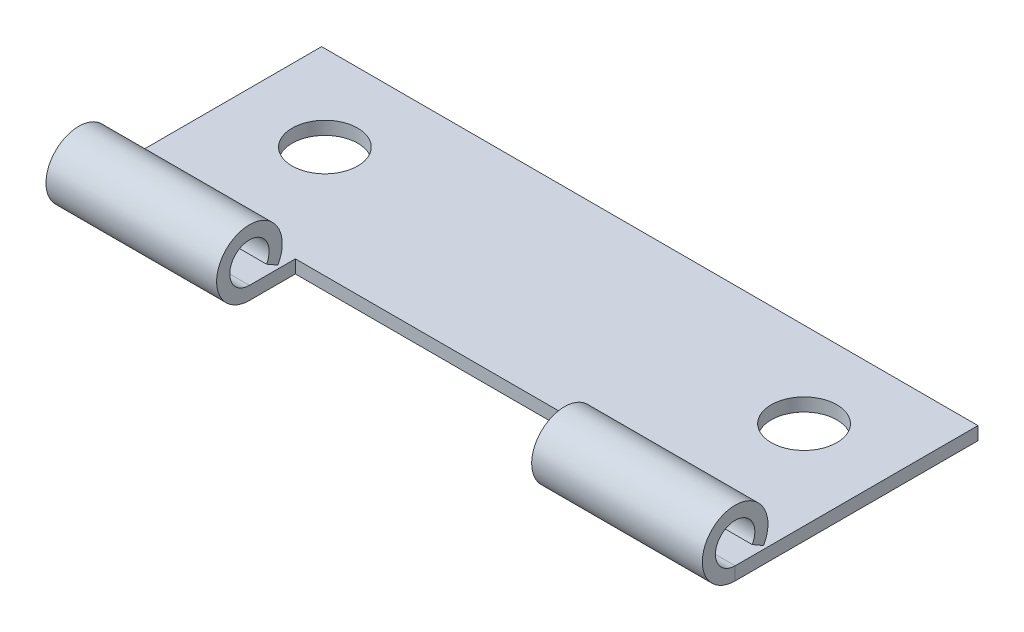
ISO-10303-21;
HEADER;
FILE_DESCRIPTION(('STEP AP214'),'2;1');
FILE_NAME('part.step','',(''),(''),'','','');
FILE_SCHEMA(('AUTOMOTIVE_DESIGN { 1 0 10303 214 1 1 1 1 }'));
ENDSEC;
DATA;
#1=APPLICATION_CONTEXT('core data for automotive mechanical design processes');
#2=APPLICATION_PROTOCOL_DEFINITION('international standard','automotive_design',2000,#1);
#3=PRODUCT_CONTEXT('',#1,'mechanical');
#4=PRODUCT('Part','Part','',(#3));
#5=PRODUCT_RELATED_PRODUCT_CATEGORY('part','',(#4));
#6=PRODUCT_DEFINITION_FORMATION('','',#4);
#7=PRODUCT_DEFINITION_CONTEXT('part definition',#1,'design');
#8=PRODUCT_DEFINITION('design','',#6,#7);
#9=PRODUCT_DEFINITION_SHAPE('','',#8);
#10=(LENGTH_UNIT() NAMED_UNIT(*) SI_UNIT(.MILLI.,.METRE.));
#11=(NAMED_UNIT(*) PLANE_ANGLE_UNIT() SI_UNIT($,.RADIAN.));
#12=(NAMED_UNIT(*) SI_UNIT($,.STERADIAN.) SOLID_ANGLE_UNIT());
#13=UNCERTAINTY_MEASURE_WITH_UNIT(LENGTH_MEASURE(1.E-05),#10,'distance_accuracy_value','');
#14=(GEOMETRIC_REPRESENTATION_CONTEXT(3) GLOBAL_UNCERTAINTY_ASSIGNED_CONTEXT((#13)) GLOBAL_UNIT_ASSIGNED_CONTEXT((#10,
#11,#12)) REPRESENTATION_CONTEXT('',''));
#15=CARTESIAN_POINT('',(0.,0.,0.));
#16=DIRECTION('',(0.,0.,1.));
#17=DIRECTION('',(1.,0.,0.));
#18=AXIS2_PLACEMENT_3D('',#15,#16,#17);
#19=CARTESIAN_POINT('',(0.,0.749999999999984,6.70096189432335));
#20=DIRECTION('',(0.,0.866025403784433,-0.50000000000001));
#21=DIRECTION('',(1.,0.,0.));
#22=AXIS2_PLACEMENT_3D('',#19,#20,#21);
#23=PLANE('',#22);
#24=DIRECTION('',(0.,0.50000000000001,0.866025403784433));
#25=VECTOR('',#24,1.);
#26=CARTESIAN_POINT('',(-12.,0.749999999999985,6.70096189432335));
#27=LINE('',#26,#25);
#28=CARTESIAN_POINT('',(-12.,0.749999999999984,6.70096189432335));
#29=VERTEX_POINT('',#28);
#30=CARTESIAN_POINT('',(-12.,0.249999999999975,5.83493649053892));
#31=VERTEX_POINT('',#30);
#32=EDGE_CURVE('E159',#29,#31,#27,.F.);
#33=ORIENTED_EDGE('',*,*,#32,.F.);
#34=DIRECTION('',(1.,0.,0.));
#35=VECTOR('',#34,1.);
#36=CARTESIAN_POINT('',(25.,0.749999999999982,6.70096189432335));
#37=LINE('',#36,#35);
#38=CARTESIAN_POINT('',(-25.,0.749999999999986,6.70096189432335));
#39=VERTEX_POINT('',#38);
#40=EDGE_CURVE('E189',#39,#29,#37,.T.);
#41=ORIENTED_EDGE('',*,*,#40,.F.);
#42=DIRECTION('',(0.,-0.50000000000001,-0.866025403784433));
#43=VECTOR('',#42,1.);
#44=CARTESIAN_POINT('',(-25.,0.749999999999986,6.70096189432335));
#45=LINE('',#44,#43);
#46=CARTESIAN_POINT('',(-25.,0.249999999999976,5.83493649053892));
#47=VERTEX_POINT('',#46);
#48=EDGE_CURVE('E195',#39,#47,#45,.T.);
#49=ORIENTED_EDGE('',*,*,#48,.T.);
#50=DIRECTION('',(1.,0.,0.));
#51=VECTOR('',#50,1.);
#52=CARTESIAN_POINT('',(25.,0.249999999999972,5.83493649053892));
#53=LINE('',#52,#51);
#54=EDGE_CURVE('E172',#47,#31,#53,.T.);
#55=ORIENTED_EDGE('',*,*,#54,.T.);
#56=EDGE_LOOP('',(#33,#41,#49,#55));
#57=FACE_BOUND('',#56,.T.);
#58=ADVANCED_FACE('F35',(#57),#23,.F.);
#59=CARTESIAN_POINT('',(25.,1.5,8.));
#60=DIRECTION('',(1.,0.,0.));
#61=DIRECTION('',(0.,-0.50000000000001,-0.866025403784433));
#62=AXIS2_PLACEMENT_3D('',#59,#60,#61);
#63=CYLINDRICAL_SURFACE('',#62,2.5);
#64=CARTESIAN_POINT('',(12.,1.5,8.));
#65=DIRECTION('',(1.,0.,0.));
#66=DIRECTION('',(0.,0.,-1.));
#67=AXIS2_PLACEMENT_3D('',#64,#65,#66);
#68=CIRCLE('',#67,2.5);
#69=CARTESIAN_POINT('',(12.,-1.,8.));
#70=VERTEX_POINT('',#69);
#71=CARTESIAN_POINT('',(12.,0.249999999999974,5.83493649053892));
#72=VERTEX_POINT('',#71);
#73=EDGE_CURVE('E157',#70,#72,#68,.F.);
#74=ORIENTED_EDGE('',*,*,#73,.F.);
#75=DIRECTION('',(1.,0.,0.));
#76=VECTOR('',#75,1.);
#77=CARTESIAN_POINT('',(25.,-1.,8.));
#78=LINE('',#77,#76);
#79=CARTESIAN_POINT('',(25.,-1.,7.99999999999999));
#80=VERTEX_POINT('',#79);
#81=EDGE_CURVE('E147',#80,#70,#78,.F.);
#82=ORIENTED_EDGE('',*,*,#81,.F.);
#83=CARTESIAN_POINT('',(25.,1.5,8.));
#84=DIRECTION('',(1.,0.,0.));
#85=DIRECTION('',(0.,1.,0.));
#86=AXIS2_PLACEMENT_3D('',#83,#84,#85);
#87=CIRCLE('',#86,2.5);
#88=CARTESIAN_POINT('',(25.,0.249999999999972,5.83493649053892));
#89=VERTEX_POINT('',#88);
#90=EDGE_CURVE('E175',#89,#80,#87,.T.);
#91=ORIENTED_EDGE('',*,*,#90,.F.);
#92=EDGE_CURVE('E176',#72,#89,#53,.T.);
#93=ORIENTED_EDGE('',*,*,#92,.F.);
#94=EDGE_LOOP('',(#74,#82,#91,#93));
#95=FACE_BOUND('',#94,.T.);
#96=ADVANCED_FACE('F256',(#95),#63,.T.);
#97=CARTESIAN_POINT('',(25.,1.5,8.));
#98=DIRECTION('',(1.,0.,0.));
#99=DIRECTION('',(0.,-0.50000000000001,-0.866025403784433));
#100=AXIS2_PLACEMENT_3D('',#97,#98,#99);
#101=CYLINDRICAL_SURFACE('',#100,1.5);
#102=ORIENTED_EDGE('',*,*,#40,.T.);
#103=CARTESIAN_POINT('',(-12.,1.5,8.));
#104=DIRECTION('',(-1.,0.,0.));
#105=DIRECTION('',(0.,0.,1.));
#106=AXIS2_PLACEMENT_3D('',#103,#104,#105);
#107=CIRCLE('',#106,1.5);
#108=CARTESIAN_POINT('',(-12.,0.,8.));
#109=VERTEX_POINT('',#108);
#110=EDGE_CURVE('E44',#29,#109,#107,.F.);
#111=ORIENTED_EDGE('',*,*,#110,.T.);
#112=DIRECTION('',(1.,0.,0.));
#113=VECTOR('',#112,1.);
#114=CARTESIAN_POINT('',(25.,0.,8.));
#115=LINE('',#114,#113);
#116=CARTESIAN_POINT('',(-25.,0.,8.));
#117=VERTEX_POINT('',#116);
#118=EDGE_CURVE('E185',#109,#117,#115,.F.);
#119=ORIENTED_EDGE('',*,*,#118,.T.);
#120=CARTESIAN_POINT('',(-25.,1.5,8.));
#121=DIRECTION('',(1.,0.,0.));
#122=DIRECTION('',(0.,1.,0.));
#123=AXIS2_PLACEMENT_3D('',#120,#121,#122);
#124=CIRCLE('',#123,1.5);
#125=EDGE_CURVE('E179',#117,#39,#124,.F.);
#126=ORIENTED_EDGE('',*,*,#125,.T.);
#127=EDGE_LOOP('',(#102,#111,#119,#126));
#128=FACE_BOUND('',#127,.T.);
#129=ADVANCED_FACE('F262',(#128),#101,.F.);
#130=CARTESIAN_POINT('',(25.,-1.,-10.5));
#131=DIRECTION('',(1.,0.,0.));
#132=DIRECTION('',(0.,0.,-1.));
#133=AXIS2_PLACEMENT_3D('',#130,#131,#132);
#134=PLANE('',#133);
#135=DIRECTION('',(0.,0.,-1.));
#136=VECTOR('',#135,1.);
#137=CARTESIAN_POINT('',(25.,0.,-10.5));
#138=LINE('',#137,#136);
#139=CARTESIAN_POINT('',(25.,0.,7.99999999999999));
#140=VERTEX_POINT('',#139);
#141=CARTESIAN_POINT('',(25.,0.,-10.5));
#142=VERTEX_POINT('',#141);
#143=EDGE_CURVE('E200',#140,#142,#138,.T.);
#144=ORIENTED_EDGE('',*,*,#143,.F.);
#145=DIRECTION('',(0.,-1.,0.));
#146=VECTOR('',#145,1.);
#147=CARTESIAN_POINT('',(25.,0.,8.));
#148=LINE('',#147,#146);
#149=EDGE_CURVE('E60',#140,#80,#148,.T.);
#150=ORIENTED_EDGE('',*,*,#149,.T.);
#151=DIRECTION('',(0.,0.,-1.));
#152=VECTOR('',#151,1.);
#153=CARTESIAN_POINT('',(25.,-1.,-10.5));
#154=LINE('',#153,#152);
#155=CARTESIAN_POINT('',(25.,-1.,-10.5));
#156=VERTEX_POINT('',#155);
#157=EDGE_CURVE('E202',#80,#156,#154,.T.);
#158=ORIENTED_EDGE('',*,*,#157,.T.);
#159=DIRECTION('',(0.,1.,0.));
#160=VECTOR('',#159,1.);
#161=CARTESIAN_POINT('',(25.,-1.,-10.5));
#162=LINE('',#161,#160);
#163=EDGE_CURVE('E211',#156,#142,#162,.T.);
#164=ORIENTED_EDGE('',*,*,#163,.T.);
#165=EDGE_LOOP('',(#144,#150,#158,#164));
#166=FACE_BOUND('',#165,.T.);
#167=ADVANCED_FACE('F37',(#166),#134,.T.);
#168=CARTESIAN_POINT('',(-25.,-1.,-10.5));
#169=DIRECTION('',(-1.,0.,0.));
#170=DIRECTION('',(0.,0.,1.));
#171=AXIS2_PLACEMENT_3D('',#168,#169,#170);
#172=PLANE('',#171);
#173=DIRECTION('',(0.,-1.,0.));
#174=VECTOR('',#173,1.);
#175=CARTESIAN_POINT('',(-25.,0.,8.));
#176=LINE('',#175,#174);
#177=CARTESIAN_POINT('',(-25.,-1.,8.));
#178=VERTEX_POINT('',#177);
#179=EDGE_CURVE('E192',#117,#178,#176,.T.);
#180=ORIENTED_EDGE('',*,*,#179,.F.);
#181=DIRECTION('',(0.,0.,1.));
#182=VECTOR('',#181,1.);
#183=CARTESIAN_POINT('',(-25.,0.,-10.5));
#184=LINE('',#183,#182);
#185=CARTESIAN_POINT('',(-25.,0.,-10.5));
#186=VERTEX_POINT('',#185);
#187=EDGE_CURVE('E205',#186,#117,#184,.T.);
#188=ORIENTED_EDGE('',*,*,#187,.F.);
#189=DIRECTION('',(0.,1.,0.));
#190=VECTOR('',#189,1.);
#191=CARTESIAN_POINT('',(-25.,-1.,-10.5));
#192=LINE('',#191,#190);
#193=CARTESIAN_POINT('',(-25.,-1.,-10.5));
#194=VERTEX_POINT('',#193);
#195=EDGE_CURVE('E218',#194,#186,#192,.T.);
#196=ORIENTED_EDGE('',*,*,#195,.F.);
#197=DIRECTION('',(0.,0.,1.));
#198=VECTOR('',#197,1.);
#199=CARTESIAN_POINT('',(-25.,-1.,-10.5));
#200=LINE('',#199,#198);
#201=EDGE_CURVE('E208',#194,#178,#200,.T.);
#202=ORIENTED_EDGE('',*,*,#201,.T.);
#203=EDGE_LOOP('',(#180,#188,#196,#202));
#204=FACE_BOUND('',#203,.T.);
#205=ADVANCED_FACE('F252',(#204),#172,.T.);
#206=CARTESIAN_POINT('',(-25.,-1.,-10.5));
#207=DIRECTION('',(0.,0.,-1.));
#208=DIRECTION('',(-1.,0.,0.));
#209=AXIS2_PLACEMENT_3D('',#206,#207,#208);
#210=PLANE('',#209);
#211=DIRECTION('',(-1.,0.,0.));
#212=VECTOR('',#211,1.);
#213=CARTESIAN_POINT('',(-25.,0.,-10.5));
#214=LINE('',#213,#212);
#215=EDGE_CURVE('E213',#142,#186,#214,.T.);
#216=ORIENTED_EDGE('',*,*,#215,.F.);
#217=ORIENTED_EDGE('',*,*,#163,.F.);
#218=DIRECTION('',(-1.,0.,0.));
#219=VECTOR('',#218,1.);
#220=CARTESIAN_POINT('',(-25.,-1.,-10.5));
#221=LINE('',#220,#219);
#222=EDGE_CURVE('E204',#156,#194,#221,.T.);
#223=ORIENTED_EDGE('',*,*,#222,.T.);
#224=ORIENTED_EDGE('',*,*,#195,.T.);
#225=EDGE_LOOP('',(#216,#217,#223,#224));
#226=FACE_BOUND('',#225,.T.);
#227=ADVANCED_FACE('F243',(#226),#210,.T.);
#228=CARTESIAN_POINT('',(25.,-1.,10.5));
#229=DIRECTION('',(0.,1.,0.));
#230=DIRECTION('',(0.,0.,1.));
#231=AXIS2_PLACEMENT_3D('',#228,#229,#230);
#232=PLANE('',#231);
#233=CARTESIAN_POINT('',(-18.25,-1.,-4.));
#234=DIRECTION('',(0.,-1.,0.));
#235=DIRECTION('',(0.,0.,-1.));
#236=AXIS2_PLACEMENT_3D('',#233,#234,#235);
#237=CIRCLE('',#236,2.5);
#238=CARTESIAN_POINT('',(-18.25,-1.,-6.5));
#239=VERTEX_POINT('',#238);
#240=EDGE_CURVE('E233',#239,#239,#237,.T.);
#241=ORIENTED_EDGE('',*,*,#240,.F.);
#242=EDGE_LOOP('',(#241));
#243=FACE_BOUND('',#242,.T.);
#244=CARTESIAN_POINT('',(18.25,-1.,-4.));
#245=DIRECTION('',(0.,-1.,0.));
#246=DIRECTION('',(0.,0.,-1.));
#247=AXIS2_PLACEMENT_3D('',#244,#245,#246);
#248=CIRCLE('',#247,2.5);
#249=CARTESIAN_POINT('',(18.25,-1.,-6.50000000000001));
#250=VERTEX_POINT('',#249);
#251=EDGE_CURVE('E226',#250,#250,#248,.T.);
#252=ORIENTED_EDGE('',*,*,#251,.F.);
#253=EDGE_LOOP('',(#252));
#254=FACE_BOUND('',#253,.T.);
#255=DIRECTION('',(-1.,0.,0.));
#256=VECTOR('',#255,1.);
#257=CARTESIAN_POINT('',(-12.,-1.,4.5));
#258=LINE('',#257,#256);
#259=CARTESIAN_POINT('',(12.,-1.,4.49999999999999));
#260=VERTEX_POINT('',#259);
#261=CARTESIAN_POINT('',(-12.,-1.,4.5));
#262=VERTEX_POINT('',#261);
#263=EDGE_CURVE('E135',#260,#262,#258,.T.);
#264=ORIENTED_EDGE('',*,*,#263,.T.);
#265=DIRECTION('',(0.,0.,1.));
#266=VECTOR('',#265,1.);
#267=CARTESIAN_POINT('',(-12.,-1.,4.5));
#268=LINE('',#267,#266);
#269=CARTESIAN_POINT('',(-12.,-1.,8.));
#270=VERTEX_POINT('',#269);
#271=EDGE_CURVE('E148',#262,#270,#268,.T.);
#272=ORIENTED_EDGE('',*,*,#271,.T.);
#273=EDGE_CURVE('E169',#270,#178,#78,.F.);
#274=ORIENTED_EDGE('',*,*,#273,.T.);
#275=ORIENTED_EDGE('',*,*,#201,.F.);
#276=ORIENTED_EDGE('',*,*,#222,.F.);
#277=ORIENTED_EDGE('',*,*,#157,.F.);
#278=ORIENTED_EDGE('',*,*,#81,.T.);
#279=DIRECTION('',(0.,0.,-1.));
#280=VECTOR('',#279,1.);
#281=CARTESIAN_POINT('',(12.,-1.,4.49999999999999));
#282=LINE('',#281,#280);
#283=EDGE_CURVE('E128',#70,#260,#282,.T.);
#284=ORIENTED_EDGE('',*,*,#283,.T.);
#285=EDGE_LOOP('',(#264,#272,#274,#275,#276,#277,#278,#284));
#286=FACE_BOUND('',#285,.T.);
#287=ADVANCED_FACE('F145',(#243,#254,#286),#232,.F.);
#288=CARTESIAN_POINT('',(25.,0.,10.5));
#289=DIRECTION('',(0.,1.,0.));
#290=DIRECTION('',(0.,0.,1.));
#291=AXIS2_PLACEMENT_3D('',#288,#289,#290);
#292=PLANE('',#291);
#293=CARTESIAN_POINT('',(-18.25,0.,-4.));
#294=DIRECTION('',(0.,1.,0.));
#295=DIRECTION('',(0.,0.,1.));
#296=AXIS2_PLACEMENT_3D('',#293,#294,#295);
#297=CIRCLE('',#296,2.5);
#298=CARTESIAN_POINT('',(-18.25,0.,-1.5));
#299=VERTEX_POINT('',#298);
#300=EDGE_CURVE('E39',#299,#299,#297,.T.);
#301=ORIENTED_EDGE('',*,*,#300,.F.);
#302=EDGE_LOOP('',(#301));
#303=FACE_BOUND('',#302,.T.);
#304=CARTESIAN_POINT('',(18.25,0.,-4.));
#305=DIRECTION('',(0.,1.,0.));
#306=DIRECTION('',(0.,0.,1.));
#307=AXIS2_PLACEMENT_3D('',#304,#305,#306);
#308=CIRCLE('',#307,2.5);
#309=CARTESIAN_POINT('',(18.25,0.,-1.5));
#310=VERTEX_POINT('',#309);
#311=EDGE_CURVE('E150',#310,#310,#308,.T.);
#312=ORIENTED_EDGE('',*,*,#311,.F.);
#313=EDGE_LOOP('',(#312));
#314=FACE_BOUND('',#313,.T.);
#315=DIRECTION('',(0.,0.,1.));
#316=VECTOR('',#315,1.);
#317=CARTESIAN_POINT('',(-12.,0.,10.5));
#318=LINE('',#317,#316);
#319=CARTESIAN_POINT('',(-12.,0.,4.5));
#320=VERTEX_POINT('',#319);
#321=EDGE_CURVE('E162',#320,#109,#318,.T.);
#322=ORIENTED_EDGE('',*,*,#321,.F.);
#323=DIRECTION('',(-1.,0.,0.));
#324=VECTOR('',#323,1.);
#325=CARTESIAN_POINT('',(25.,0.,4.49999999999999));
#326=LINE('',#325,#324);
#327=CARTESIAN_POINT('',(12.,0.,4.49999999999999));
#328=VERTEX_POINT('',#327);
#329=EDGE_CURVE('E11',#328,#320,#326,.T.);
#330=ORIENTED_EDGE('',*,*,#329,.F.);
#331=DIRECTION('',(0.,0.,-1.));
#332=VECTOR('',#331,1.);
#333=CARTESIAN_POINT('',(12.,0.,10.5));
#334=LINE('',#333,#332);
#335=CARTESIAN_POINT('',(12.,0.,8.));
#336=VERTEX_POINT('',#335);
#337=EDGE_CURVE('E131',#336,#328,#334,.T.);
#338=ORIENTED_EDGE('',*,*,#337,.F.);
#339=EDGE_CURVE('E182',#140,#336,#115,.F.);
#340=ORIENTED_EDGE('',*,*,#339,.F.);
#341=ORIENTED_EDGE('',*,*,#143,.T.);
#342=ORIENTED_EDGE('',*,*,#215,.T.);
#343=ORIENTED_EDGE('',*,*,#187,.T.);
#344=ORIENTED_EDGE('',*,*,#118,.F.);
#345=EDGE_LOOP('',(#322,#330,#338,#340,#341,#342,#343,#344));
#346=FACE_BOUND('',#345,.T.);
#347=ADVANCED_FACE('F242',(#303,#314,#346),#292,.T.);
#348=DIRECTION('',(0.,-0.50000000000001,-0.866025403784433));
#349=VECTOR('',#348,1.);
#350=CARTESIAN_POINT('',(12.,0.749999999999984,6.70096189432335));
#351=LINE('',#350,#349);
#352=CARTESIAN_POINT('',(12.,0.749999999999983,6.70096189432335));
#353=VERTEX_POINT('',#352);
#354=EDGE_CURVE('E52',#72,#353,#351,.F.);
#355=ORIENTED_EDGE('',*,*,#354,.F.);
#356=ORIENTED_EDGE('',*,*,#92,.T.);
#357=DIRECTION('',(0.,-0.50000000000001,-0.866025403784433));
#358=VECTOR('',#357,1.);
#359=CARTESIAN_POINT('',(25.,0.749999999999982,6.70096189432335));
#360=LINE('',#359,#358);
#361=CARTESIAN_POINT('',(25.,0.749999999999982,6.70096189432335));
#362=VERTEX_POINT('',#361);
#363=EDGE_CURVE('E197',#362,#89,#360,.T.);
#364=ORIENTED_EDGE('',*,*,#363,.F.);
#365=EDGE_CURVE('E166',#353,#362,#37,.T.);
#366=ORIENTED_EDGE('',*,*,#365,.F.);
#367=EDGE_LOOP('',(#355,#356,#364,#366));
#368=FACE_BOUND('',#367,.T.);
#369=ADVANCED_FACE('F249',(#368),#23,.F.);
#370=CARTESIAN_POINT('',(-25.,1.5,8.));
#371=DIRECTION('',(-1.,0.,0.));
#372=DIRECTION('',(0.,-1.,0.));
#373=AXIS2_PLACEMENT_3D('',#370,#371,#372);
#374=PLANE('',#373);
#375=ORIENTED_EDGE('',*,*,#48,.F.);
#376=ORIENTED_EDGE('',*,*,#125,.F.);
#377=ORIENTED_EDGE('',*,*,#179,.T.);
#378=CARTESIAN_POINT('',(-25.,1.5,8.));
#379=DIRECTION('',(1.,0.,0.));
#380=DIRECTION('',(0.,1.,0.));
#381=AXIS2_PLACEMENT_3D('',#378,#379,#380);
#382=CIRCLE('',#381,2.5);
#383=EDGE_CURVE('E168',#178,#47,#382,.F.);
#384=ORIENTED_EDGE('',*,*,#383,.T.);
#385=EDGE_LOOP('',(#375,#376,#377,#384));
#386=FACE_BOUND('',#385,.T.);
#387=ADVANCED_FACE('F269',(#386),#374,.T.);
#388=CARTESIAN_POINT('',(25.,1.5,8.));
#389=DIRECTION('',(-1.,0.,0.));
#390=DIRECTION('',(0.,-1.,0.));
#391=AXIS2_PLACEMENT_3D('',#388,#389,#390);
#392=PLANE('',#391);
#393=CARTESIAN_POINT('',(25.,1.5,8.));
#394=DIRECTION('',(1.,0.,0.));
#395=DIRECTION('',(0.,1.,0.));
#396=AXIS2_PLACEMENT_3D('',#393,#394,#395);
#397=CIRCLE('',#396,1.5);
#398=EDGE_CURVE('E186',#362,#140,#397,.T.);
#399=ORIENTED_EDGE('',*,*,#398,.F.);
#400=ORIENTED_EDGE('',*,*,#363,.T.);
#401=ORIENTED_EDGE('',*,*,#90,.T.);
#402=ORIENTED_EDGE('',*,*,#149,.F.);
#403=EDGE_LOOP('',(#399,#400,#401,#402));
#404=FACE_BOUND('',#403,.T.);
#405=ADVANCED_FACE('F274',(#404),#392,.F.);
#406=CARTESIAN_POINT('',(-12.,1.5,8.));
#407=DIRECTION('',(-1.,0.,0.));
#408=DIRECTION('',(0.,0.,1.));
#409=AXIS2_PLACEMENT_3D('',#406,#407,#408);
#410=CIRCLE('',#409,2.5);
#411=EDGE_CURVE('E164',#31,#270,#410,.F.);
#412=ORIENTED_EDGE('',*,*,#411,.F.);
#413=ORIENTED_EDGE('',*,*,#54,.F.);
#414=ORIENTED_EDGE('',*,*,#383,.F.);
#415=ORIENTED_EDGE('',*,*,#273,.F.);
#416=EDGE_LOOP('',(#412,#413,#414,#415));
#417=FACE_BOUND('',#416,.T.);
#418=ADVANCED_FACE('F265',(#417),#63,.T.);
#419=ORIENTED_EDGE('',*,*,#339,.T.);
#420=CARTESIAN_POINT('',(12.,1.5,8.));
#421=DIRECTION('',(1.,0.,0.));
#422=DIRECTION('',(0.,0.,-1.));
#423=AXIS2_PLACEMENT_3D('',#420,#421,#422);
#424=CIRCLE('',#423,1.5);
#425=EDGE_CURVE('E220',#336,#353,#424,.F.);
#426=ORIENTED_EDGE('',*,*,#425,.T.);
#427=ORIENTED_EDGE('',*,*,#365,.T.);
#428=ORIENTED_EDGE('',*,*,#398,.T.);
#429=EDGE_LOOP('',(#419,#426,#427,#428));
#430=FACE_BOUND('',#429,.T.);
#431=ADVANCED_FACE('F283',(#430),#101,.F.);
#432=CARTESIAN_POINT('',(-12.,-1.,4.5));
#433=DIRECTION('',(-1.,0.,0.));
#434=DIRECTION('',(0.,0.,1.));
#435=AXIS2_PLACEMENT_3D('',#432,#433,#434);
#436=PLANE('',#435);
#437=ORIENTED_EDGE('',*,*,#411,.T.);
#438=ORIENTED_EDGE('',*,*,#271,.F.);
#439=DIRECTION('',(0.,1.,0.));
#440=VECTOR('',#439,1.);
#441=CARTESIAN_POINT('',(-12.,-1.,4.5));
#442=LINE('',#441,#440);
#443=EDGE_CURVE('E134',#262,#320,#442,.T.);
#444=ORIENTED_EDGE('',*,*,#443,.T.);
#445=ORIENTED_EDGE('',*,*,#321,.T.);
#446=ORIENTED_EDGE('',*,*,#110,.F.);
#447=ORIENTED_EDGE('',*,*,#32,.T.);
#448=EDGE_LOOP('',(#437,#438,#444,#445,#446,#447));
#449=FACE_BOUND('',#448,.T.);
#450=ADVANCED_FACE('F288',(#449),#436,.F.);
#451=CARTESIAN_POINT('',(-12.,-1.,4.5));
#452=DIRECTION('',(0.,0.,-1.));
#453=DIRECTION('',(-1.,0.,0.));
#454=AXIS2_PLACEMENT_3D('',#451,#452,#453);
#455=PLANE('',#454);
#456=ORIENTED_EDGE('',*,*,#329,.T.);
#457=ORIENTED_EDGE('',*,*,#443,.F.);
#458=ORIENTED_EDGE('',*,*,#263,.F.);
#459=DIRECTION('',(0.,1.,0.));
#460=VECTOR('',#459,1.);
#461=CARTESIAN_POINT('',(12.,-1.,4.49999999999999));
#462=LINE('',#461,#460);
#463=EDGE_CURVE('E124',#260,#328,#462,.T.);
#464=ORIENTED_EDGE('',*,*,#463,.T.);
#465=EDGE_LOOP('',(#456,#457,#458,#464));
#466=FACE_BOUND('',#465,.T.);
#467=ADVANCED_FACE('F138',(#466),#455,.F.);
#468=CARTESIAN_POINT('',(12.,-1.,4.49999999999999));
#469=DIRECTION('',(1.,0.,0.));
#470=DIRECTION('',(0.,0.,-1.));
#471=AXIS2_PLACEMENT_3D('',#468,#469,#470);
#472=PLANE('',#471);
#473=ORIENTED_EDGE('',*,*,#73,.T.);
#474=ORIENTED_EDGE('',*,*,#354,.T.);
#475=ORIENTED_EDGE('',*,*,#425,.F.);
#476=ORIENTED_EDGE('',*,*,#337,.T.);
#477=ORIENTED_EDGE('',*,*,#463,.F.);
#478=ORIENTED_EDGE('',*,*,#283,.F.);
#479=EDGE_LOOP('',(#473,#474,#475,#476,#477,#478));
#480=FACE_BOUND('',#479,.T.);
#481=ADVANCED_FACE('F126',(#480),#472,.F.);
#482=CARTESIAN_POINT('',(18.25,4.,-4.));
#483=DIRECTION('',(0.,-1.,0.));
#484=DIRECTION('',(0.,0.,-1.));
#485=AXIS2_PLACEMENT_3D('',#482,#483,#484);
#486=CYLINDRICAL_SURFACE('',#485,2.5);
#487=ORIENTED_EDGE('',*,*,#311,.T.);
#488=EDGE_LOOP('',(#487));
#489=FACE_BOUND('',#488,.T.);
#490=ORIENTED_EDGE('',*,*,#251,.T.);
#491=EDGE_LOOP('',(#490));
#492=FACE_BOUND('',#491,.T.);
#493=ADVANCED_FACE('F357',(#489,#492),#486,.F.);
#494=CARTESIAN_POINT('',(-18.25,4.,-4.));
#495=DIRECTION('',(0.,-1.,0.));
#496=DIRECTION('',(0.,0.,-1.));
#497=AXIS2_PLACEMENT_3D('',#494,#495,#496);
#498=CYLINDRICAL_SURFACE('',#497,2.5);
#499=ORIENTED_EDGE('',*,*,#300,.T.);
#500=EDGE_LOOP('',(#499));
#501=FACE_BOUND('',#500,.T.);
#502=ORIENTED_EDGE('',*,*,#240,.T.);
#503=EDGE_LOOP('',(#502));
#504=FACE_BOUND('',#503,.T.);
#505=ADVANCED_FACE('F238',(#501,#504),#498,.F.);
#506=CLOSED_SHELL('',(#58,#96,#129,#167,#205,#227,#287,#347,#369,#387,#405,#418,#431,#450,#467,
#481,#493,#505));
#507=MANIFOLD_SOLID_BREP('B2',#506);
#508=ADVANCED_BREP_SHAPE_REPRESENTATION('',(#18,#507),#14);
#509=SHAPE_DEFINITION_REPRESENTATION(#9,#508);
ENDSEC;
END-ISO-10303-21;
